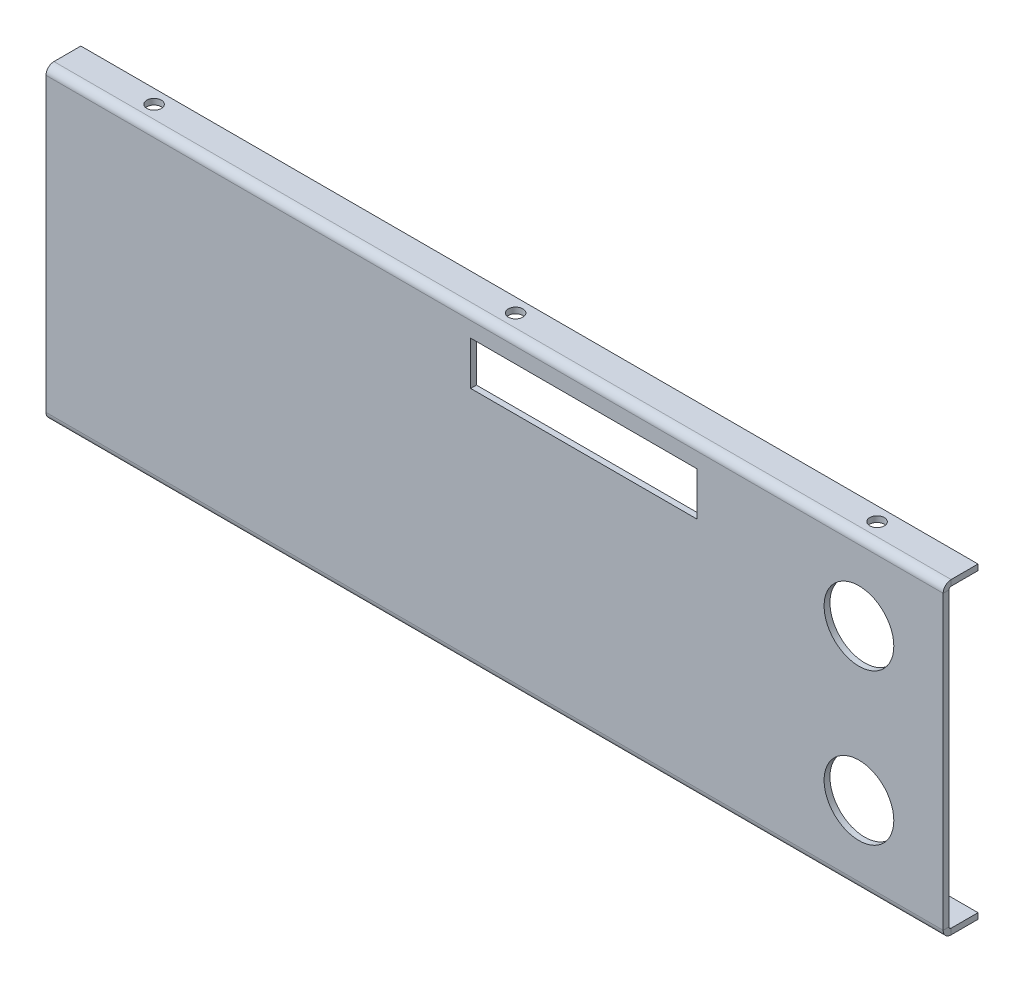
ISO-10303-21;
HEADER;
FILE_DESCRIPTION(('STEP AP214'),'2;1');
FILE_NAME('part.step','',(''),(''),'','','');
FILE_SCHEMA(('AUTOMOTIVE_DESIGN { 1 0 10303 214 1 1 1 1 }'));
ENDSEC;
DATA;
#1=APPLICATION_CONTEXT('core data for automotive mechanical design processes');
#2=APPLICATION_PROTOCOL_DEFINITION('international standard','automotive_design',2000,#1);
#3=PRODUCT_CONTEXT('',#1,'mechanical');
#4=PRODUCT('Part','Part','',(#3));
#5=PRODUCT_RELATED_PRODUCT_CATEGORY('part','',(#4));
#6=PRODUCT_DEFINITION_FORMATION('','',#4);
#7=PRODUCT_DEFINITION_CONTEXT('part definition',#1,'design');
#8=PRODUCT_DEFINITION('design','',#6,#7);
#9=PRODUCT_DEFINITION_SHAPE('','',#8);
#10=(LENGTH_UNIT() NAMED_UNIT(*) SI_UNIT(.MILLI.,.METRE.));
#11=(NAMED_UNIT(*) PLANE_ANGLE_UNIT() SI_UNIT($,.RADIAN.));
#12=(NAMED_UNIT(*) SI_UNIT($,.STERADIAN.) SOLID_ANGLE_UNIT());
#13=UNCERTAINTY_MEASURE_WITH_UNIT(LENGTH_MEASURE(1.E-05),#10,'distance_accuracy_value','');
#14=(GEOMETRIC_REPRESENTATION_CONTEXT(3) GLOBAL_UNCERTAINTY_ASSIGNED_CONTEXT((#13)) GLOBAL_UNIT_ASSIGNED_CONTEXT((#10,
#11,#12)) REPRESENTATION_CONTEXT('',''));
#15=CARTESIAN_POINT('',(0.,0.,0.));
#16=DIRECTION('',(0.,0.,1.));
#17=DIRECTION('',(1.,0.,0.));
#18=AXIS2_PLACEMENT_3D('',#15,#16,#17);
#19=CARTESIAN_POINT('',(0.,0.,-2.));
#20=DIRECTION('',(0.,0.,1.));
#21=DIRECTION('',(1.,0.,0.));
#22=AXIS2_PLACEMENT_3D('',#19,#20,#21);
#23=PLANE('',#22);
#24=DIRECTION('',(-1.,0.,0.));
#25=VECTOR('',#24,1.);
#26=CARTESIAN_POINT('',(0.,98.0000000000052,-2.));
#27=LINE('',#26,#25);
#28=CARTESIAN_POINT('',(69.7866766514257,98.0000000000052,-2.));
#29=VERTEX_POINT('',#28);
#30=CARTESIAN_POINT('',(-8.24041618428802,98.0000000000052,-2.));
#31=VERTEX_POINT('',#30);
#32=EDGE_CURVE('E238',#29,#31,#27,.T.);
#33=ORIENTED_EDGE('',*,*,#32,.T.);
#34=DIRECTION('',(0.,-1.,0.));
#35=VECTOR('',#34,1.);
#36=CARTESIAN_POINT('',(-8.24041618428802,0.,-2.));
#37=LINE('',#36,#35);
#38=CARTESIAN_POINT('',(-8.24041618428802,83.0000000000055,-2.));
#39=VERTEX_POINT('',#38);
#40=EDGE_CURVE('E242',#31,#39,#37,.T.);
#41=ORIENTED_EDGE('',*,*,#40,.T.);
#42=DIRECTION('',(1.,0.,0.));
#43=VECTOR('',#42,1.);
#44=CARTESIAN_POINT('',(0.,83.0000000000055,-2.));
#45=LINE('',#44,#43);
#46=CARTESIAN_POINT('',(69.7866766514257,83.0000000000055,-2.));
#47=VERTEX_POINT('',#46);
#48=EDGE_CURVE('E229',#39,#47,#45,.T.);
#49=ORIENTED_EDGE('',*,*,#48,.T.);
#50=DIRECTION('',(0.,1.,0.));
#51=VECTOR('',#50,1.);
#52=CARTESIAN_POINT('',(69.7866766514257,0.,-2.));
#53=LINE('',#52,#51);
#54=EDGE_CURVE('E202',#47,#29,#53,.T.);
#55=ORIENTED_EDGE('',*,*,#54,.T.);
#56=EDGE_LOOP('',(#33,#41,#49,#55));
#57=FACE_BOUND('',#56,.T.);
#58=CARTESIAN_POINT('',(125.5,79.,-2.));
#59=DIRECTION('',(0.,0.,1.));
#60=DIRECTION('',(1.,0.,0.));
#61=AXIS2_PLACEMENT_3D('',#58,#59,#60);
#62=CIRCLE('',#61,12.);
#63=CARTESIAN_POINT('',(137.5,79.,-2.));
#64=VERTEX_POINT('',#63);
#65=EDGE_CURVE('E258',#64,#64,#62,.T.);
#66=ORIENTED_EDGE('',*,*,#65,.T.);
#67=EDGE_LOOP('',(#66));
#68=FACE_BOUND('',#67,.T.);
#69=CARTESIAN_POINT('',(125.5,27.,-2.));
#70=DIRECTION('',(0.,0.,1.));
#71=DIRECTION('',(1.,0.,0.));
#72=AXIS2_PLACEMENT_3D('',#69,#70,#71);
#73=CIRCLE('',#72,12.);
#74=CARTESIAN_POINT('',(137.5,27.,-2.));
#75=VERTEX_POINT('',#74);
#76=EDGE_CURVE('E251',#75,#75,#73,.T.);
#77=ORIENTED_EDGE('',*,*,#76,.T.);
#78=EDGE_LOOP('',(#77));
#79=FACE_BOUND('',#78,.T.);
#80=DIRECTION('',(1.,0.,0.));
#81=VECTOR('',#80,1.);
#82=CARTESIAN_POINT('',(154.5,103.2634,-2.00000000000002));
#83=LINE('',#82,#81);
#84=CARTESIAN_POINT('',(154.5,103.2634,-2.00000000000002));
#85=VERTEX_POINT('',#84);
#86=CARTESIAN_POINT('',(-154.5,103.2634,-2.00000000000002));
#87=VERTEX_POINT('',#86);
#88=EDGE_CURVE('E321',#85,#87,#83,.F.);
#89=ORIENTED_EDGE('',*,*,#88,.F.);
#90=DIRECTION('',(0.,1.,0.));
#91=VECTOR('',#90,1.);
#92=CARTESIAN_POINT('',(154.5,106.,-2.));
#93=LINE('',#92,#91);
#94=CARTESIAN_POINT('',(154.5,2.73659999999996,-2.00000000000001));
#95=VERTEX_POINT('',#94);
#96=EDGE_CURVE('E13',#95,#85,#93,.T.);
#97=ORIENTED_EDGE('',*,*,#96,.F.);
#98=DIRECTION('',(-1.,0.,0.));
#99=VECTOR('',#98,1.);
#100=CARTESIAN_POINT('',(-154.5,2.73659999999996,-2.00000000000001));
#101=LINE('',#100,#99);
#102=CARTESIAN_POINT('',(-154.5,2.73659999999996,-2.00000000000001));
#103=VERTEX_POINT('',#102);
#104=EDGE_CURVE('E393',#103,#95,#101,.F.);
#105=ORIENTED_EDGE('',*,*,#104,.F.);
#106=DIRECTION('',(0.,-1.,0.));
#107=VECTOR('',#106,1.);
#108=CARTESIAN_POINT('',(-154.5,106.,-2.));
#109=LINE('',#108,#107);
#110=EDGE_CURVE('E90',#87,#103,#109,.T.);
#111=ORIENTED_EDGE('',*,*,#110,.F.);
#112=EDGE_LOOP('',(#89,#97,#105,#111));
#113=FACE_BOUND('',#112,.T.);
#114=ADVANCED_FACE('F80',(#57,#68,#79,#113),#23,.F.);
#115=CARTESIAN_POINT('',(0.,0.,0.));
#116=DIRECTION('',(0.,0.,1.));
#117=DIRECTION('',(1.,0.,0.));
#118=AXIS2_PLACEMENT_3D('',#115,#116,#117);
#119=PLANE('',#118);
#120=DIRECTION('',(0.,-1.,0.));
#121=VECTOR('',#120,1.);
#122=CARTESIAN_POINT('',(-8.24041618428802,98.0000000000052,0.));
#123=LINE('',#122,#121);
#124=CARTESIAN_POINT('',(-8.24041618428802,98.0000000000052,0.));
#125=VERTEX_POINT('',#124);
#126=CARTESIAN_POINT('',(-8.24041618428802,83.0000000000055,0.));
#127=VERTEX_POINT('',#126);
#128=EDGE_CURVE('E106',#125,#127,#123,.T.);
#129=ORIENTED_EDGE('',*,*,#128,.F.);
#130=DIRECTION('',(-1.,0.,0.));
#131=VECTOR('',#130,1.);
#132=CARTESIAN_POINT('',(-8.24041618428802,98.0000000000052,0.));
#133=LINE('',#132,#131);
#134=CARTESIAN_POINT('',(69.7866766514257,98.0000000000052,0.));
#135=VERTEX_POINT('',#134);
#136=EDGE_CURVE('E217',#135,#125,#133,.T.);
#137=ORIENTED_EDGE('',*,*,#136,.F.);
#138=DIRECTION('',(0.,1.,0.));
#139=VECTOR('',#138,1.);
#140=CARTESIAN_POINT('',(69.7866766514257,98.0000000000052,0.));
#141=LINE('',#140,#139);
#142=CARTESIAN_POINT('',(69.7866766514257,83.0000000000055,0.));
#143=VERTEX_POINT('',#142);
#144=EDGE_CURVE('E199',#143,#135,#141,.T.);
#145=ORIENTED_EDGE('',*,*,#144,.F.);
#146=DIRECTION('',(1.,0.,0.));
#147=VECTOR('',#146,1.);
#148=CARTESIAN_POINT('',(-8.24041618428802,83.0000000000055,0.));
#149=LINE('',#148,#147);
#150=EDGE_CURVE('E209',#127,#143,#149,.T.);
#151=ORIENTED_EDGE('',*,*,#150,.F.);
#152=EDGE_LOOP('',(#129,#137,#145,#151));
#153=FACE_BOUND('',#152,.T.);
#154=CARTESIAN_POINT('',(125.5,79.,0.));
#155=DIRECTION('',(0.,0.,1.));
#156=DIRECTION('',(1.,0.,0.));
#157=AXIS2_PLACEMENT_3D('',#154,#155,#156);
#158=CIRCLE('',#157,12.);
#159=CARTESIAN_POINT('',(137.5,79.,0.));
#160=VERTEX_POINT('',#159);
#161=EDGE_CURVE('E247',#160,#160,#158,.T.);
#162=ORIENTED_EDGE('',*,*,#161,.F.);
#163=EDGE_LOOP('',(#162));
#164=FACE_BOUND('',#163,.T.);
#165=CARTESIAN_POINT('',(125.5,27.,0.));
#166=DIRECTION('',(0.,0.,1.));
#167=DIRECTION('',(1.,0.,0.));
#168=AXIS2_PLACEMENT_3D('',#165,#166,#167);
#169=CIRCLE('',#168,12.);
#170=CARTESIAN_POINT('',(137.5,27.,0.));
#171=VERTEX_POINT('',#170);
#172=EDGE_CURVE('E246',#171,#171,#169,.T.);
#173=ORIENTED_EDGE('',*,*,#172,.F.);
#174=EDGE_LOOP('',(#173));
#175=FACE_BOUND('',#174,.T.);
#176=DIRECTION('',(0.,1.,0.));
#177=VECTOR('',#176,1.);
#178=CARTESIAN_POINT('',(154.5,106.,0.));
#179=LINE('',#178,#177);
#180=CARTESIAN_POINT('',(154.5,2.73659999999996,0.));
#181=VERTEX_POINT('',#180);
#182=CARTESIAN_POINT('',(154.5,103.2634,0.));
#183=VERTEX_POINT('',#182);
#184=EDGE_CURVE('E409',#181,#183,#179,.T.);
#185=ORIENTED_EDGE('',*,*,#184,.T.);
#186=DIRECTION('',(1.,0.,0.));
#187=VECTOR('',#186,1.);
#188=CARTESIAN_POINT('',(154.5,103.2634,0.));
#189=LINE('',#188,#187);
#190=CARTESIAN_POINT('',(-154.5,103.2634,0.));
#191=VERTEX_POINT('',#190);
#192=EDGE_CURVE('E304',#183,#191,#189,.F.);
#193=ORIENTED_EDGE('',*,*,#192,.T.);
#194=DIRECTION('',(0.,-1.,0.));
#195=VECTOR('',#194,1.);
#196=CARTESIAN_POINT('',(-154.5,106.,0.));
#197=LINE('',#196,#195);
#198=CARTESIAN_POINT('',(-154.5,2.73659999999991,0.));
#199=VERTEX_POINT('',#198);
#200=EDGE_CURVE('E403',#191,#199,#197,.T.);
#201=ORIENTED_EDGE('',*,*,#200,.T.);
#202=DIRECTION('',(-1.,0.,0.));
#203=VECTOR('',#202,1.);
#204=CARTESIAN_POINT('',(-154.5,2.73659999999991,0.));
#205=LINE('',#204,#203);
#206=EDGE_CURVE('E376',#199,#181,#205,.F.);
#207=ORIENTED_EDGE('',*,*,#206,.T.);
#208=EDGE_LOOP('',(#185,#193,#201,#207));
#209=FACE_BOUND('',#208,.T.);
#210=ADVANCED_FACE('F214',(#153,#164,#175,#209),#119,.T.);
#211=CARTESIAN_POINT('',(154.5,106.,-2.));
#212=DIRECTION('',(1.,0.,0.));
#213=DIRECTION('',(0.,1.,0.));
#214=AXIS2_PLACEMENT_3D('',#211,#212,#213);
#215=PLANE('',#214);
#216=ORIENTED_EDGE('',*,*,#96,.T.);
#217=DIRECTION('',(0.,0.,1.));
#218=VECTOR('',#217,1.);
#219=CARTESIAN_POINT('',(154.5,103.2634,-2.00000000000002));
#220=LINE('',#219,#218);
#221=EDGE_CURVE('E313',#85,#183,#220,.T.);
#222=ORIENTED_EDGE('',*,*,#221,.T.);
#223=ORIENTED_EDGE('',*,*,#184,.F.);
#224=DIRECTION('',(0.,0.,1.));
#225=VECTOR('',#224,1.);
#226=CARTESIAN_POINT('',(154.5,2.73659999999996,-2.00000000000001));
#227=LINE('',#226,#225);
#228=EDGE_CURVE('E399',#95,#181,#227,.T.);
#229=ORIENTED_EDGE('',*,*,#228,.F.);
#230=EDGE_LOOP('',(#216,#222,#223,#229));
#231=FACE_BOUND('',#230,.T.);
#232=ADVANCED_FACE('F496',(#231),#215,.T.);
#233=CARTESIAN_POINT('',(-154.5,106.,-2.));
#234=DIRECTION('',(-1.,0.,0.));
#235=DIRECTION('',(0.,-1.,0.));
#236=AXIS2_PLACEMENT_3D('',#233,#234,#235);
#237=PLANE('',#236);
#238=DIRECTION('',(0.,0.,1.));
#239=VECTOR('',#238,1.);
#240=CARTESIAN_POINT('',(-154.5,103.2634,-2.00000000000002));
#241=LINE('',#240,#239);
#242=EDGE_CURVE('E326',#87,#191,#241,.T.);
#243=ORIENTED_EDGE('',*,*,#242,.F.);
#244=ORIENTED_EDGE('',*,*,#110,.T.);
#245=DIRECTION('',(0.,0.,1.));
#246=VECTOR('',#245,1.);
#247=CARTESIAN_POINT('',(-154.5,2.73659999999996,-2.00000000000001));
#248=LINE('',#247,#246);
#249=EDGE_CURVE('E385',#103,#199,#248,.T.);
#250=ORIENTED_EDGE('',*,*,#249,.T.);
#251=ORIENTED_EDGE('',*,*,#200,.F.);
#252=EDGE_LOOP('',(#243,#244,#250,#251));
#253=FACE_BOUND('',#252,.T.);
#254=ADVANCED_FACE('F82',(#253),#237,.T.);
#255=CARTESIAN_POINT('',(154.5,2.73659999999998,-2.73659999999999));
#256=DIRECTION('',(1.,0.,0.));
#257=DIRECTION('',(0.,0.,-1.));
#258=AXIS2_PLACEMENT_3D('',#255,#256,#257);
#259=PLANE('',#258);
#260=DIRECTION('',(0.,1.,0.));
#261=VECTOR('',#260,1.);
#262=CARTESIAN_POINT('',(154.5,0.,-2.73659999999999));
#263=LINE('',#262,#261);
#264=CARTESIAN_POINT('',(154.5,2.,-2.73659999999999));
#265=VERTEX_POINT('',#264);
#266=CARTESIAN_POINT('',(154.5,0.,-2.73659999999999));
#267=VERTEX_POINT('',#266);
#268=EDGE_CURVE('E330',#265,#267,#263,.F.);
#269=ORIENTED_EDGE('',*,*,#268,.F.);
#270=CARTESIAN_POINT('',(154.5,2.73659999999998,-2.73659999999999));
#271=DIRECTION('',(-1.,0.,0.));
#272=DIRECTION('',(0.,0.,1.));
#273=AXIS2_PLACEMENT_3D('',#270,#271,#272);
#274=CIRCLE('',#273,0.736599999999981);
#275=EDGE_CURVE('E389',#95,#265,#274,.F.);
#276=ORIENTED_EDGE('',*,*,#275,.F.);
#277=ORIENTED_EDGE('',*,*,#228,.T.);
#278=CARTESIAN_POINT('',(154.5,2.73659999999998,-2.73659999999999));
#279=DIRECTION('',(-1.,0.,0.));
#280=DIRECTION('',(0.,0.,1.));
#281=AXIS2_PLACEMENT_3D('',#278,#279,#280);
#282=CIRCLE('',#281,2.73659999999998);
#283=EDGE_CURVE('E380',#181,#267,#282,.F.);
#284=ORIENTED_EDGE('',*,*,#283,.T.);
#285=EDGE_LOOP('',(#269,#276,#277,#284));
#286=FACE_BOUND('',#285,.T.);
#287=ADVANCED_FACE('F507',(#286),#259,.T.);
#288=CARTESIAN_POINT('',(-154.5,2.73659999999998,-2.73659999999999));
#289=DIRECTION('',(1.,0.,0.));
#290=DIRECTION('',(0.,0.,-1.));
#291=AXIS2_PLACEMENT_3D('',#288,#289,#290);
#292=PLANE('',#291);
#293=CARTESIAN_POINT('',(-154.5,2.73659999999998,-2.73659999999999));
#294=DIRECTION('',(-1.,0.,0.));
#295=DIRECTION('',(0.,0.,1.));
#296=AXIS2_PLACEMENT_3D('',#293,#294,#295);
#297=CIRCLE('',#296,0.736599999999981);
#298=CARTESIAN_POINT('',(-154.5,2.,-2.73659999999999));
#299=VERTEX_POINT('',#298);
#300=EDGE_CURVE('E338',#299,#103,#297,.T.);
#301=ORIENTED_EDGE('',*,*,#300,.F.);
#302=DIRECTION('',(0.,1.,0.));
#303=VECTOR('',#302,1.);
#304=CARTESIAN_POINT('',(-154.5,1.99999999999996,-2.73659999999999));
#305=LINE('',#304,#303);
#306=CARTESIAN_POINT('',(-154.5,0.,-2.73659999999998));
#307=VERTEX_POINT('',#306);
#308=EDGE_CURVE('E366',#299,#307,#305,.F.);
#309=ORIENTED_EDGE('',*,*,#308,.T.);
#310=CARTESIAN_POINT('',(-154.5,2.73659999999998,-2.73659999999999));
#311=DIRECTION('',(-1.,0.,0.));
#312=DIRECTION('',(0.,0.,1.));
#313=AXIS2_PLACEMENT_3D('',#310,#311,#312);
#314=CIRCLE('',#313,2.73659999999998);
#315=EDGE_CURVE('E381',#307,#199,#314,.T.);
#316=ORIENTED_EDGE('',*,*,#315,.T.);
#317=ORIENTED_EDGE('',*,*,#249,.F.);
#318=EDGE_LOOP('',(#301,#309,#316,#317));
#319=FACE_BOUND('',#318,.T.);
#320=ADVANCED_FACE('F500',(#319),#292,.F.);
#321=CARTESIAN_POINT('',(-154.5,2.73659999999998,-2.73659999999999));
#322=DIRECTION('',(-1.,0.,0.));
#323=DIRECTION('',(0.,-1.,0.));
#324=AXIS2_PLACEMENT_3D('',#321,#322,#323);
#325=CYLINDRICAL_SURFACE('',#324,2.73659999999998);
#326=ORIENTED_EDGE('',*,*,#206,.F.);
#327=ORIENTED_EDGE('',*,*,#315,.F.);
#328=DIRECTION('',(-1.,0.,0.));
#329=VECTOR('',#328,1.);
#330=CARTESIAN_POINT('',(154.5,0.,-2.73659999999999));
#331=LINE('',#330,#329);
#332=EDGE_CURVE('E363',#307,#267,#331,.F.);
#333=ORIENTED_EDGE('',*,*,#332,.T.);
#334=ORIENTED_EDGE('',*,*,#283,.F.);
#335=EDGE_LOOP('',(#326,#327,#333,#334));
#336=FACE_BOUND('',#335,.T.);
#337=ADVANCED_FACE('F596',(#336),#325,.T.);
#338=CARTESIAN_POINT('',(-154.5,2.73659999999998,-2.73659999999999));
#339=DIRECTION('',(-1.,0.,0.));
#340=DIRECTION('',(0.,-1.,0.));
#341=AXIS2_PLACEMENT_3D('',#338,#339,#340);
#342=CYLINDRICAL_SURFACE('',#341,0.736599999999981);
#343=ORIENTED_EDGE('',*,*,#104,.T.);
#344=ORIENTED_EDGE('',*,*,#275,.T.);
#345=DIRECTION('',(-1.,0.,0.));
#346=VECTOR('',#345,1.);
#347=CARTESIAN_POINT('',(154.5,2.,-2.7366));
#348=LINE('',#347,#346);
#349=EDGE_CURVE('E370',#265,#299,#348,.T.);
#350=ORIENTED_EDGE('',*,*,#349,.T.);
#351=ORIENTED_EDGE('',*,*,#300,.T.);
#352=EDGE_LOOP('',(#343,#344,#350,#351));
#353=FACE_BOUND('',#352,.T.);
#354=ADVANCED_FACE('F594',(#353),#342,.F.);
#355=CARTESIAN_POINT('',(-154.5,0.,-12.));
#356=DIRECTION('',(1.,0.,0.));
#357=DIRECTION('',(0.,1.,0.));
#358=AXIS2_PLACEMENT_3D('',#355,#356,#357);
#359=PLANE('',#358);
#360=ORIENTED_EDGE('',*,*,#308,.F.);
#361=DIRECTION('',(0.,0.,1.));
#362=VECTOR('',#361,1.);
#363=CARTESIAN_POINT('',(-154.5,1.99999999999993,-12.));
#364=LINE('',#363,#362);
#365=CARTESIAN_POINT('',(-154.5,1.99999999999993,-12.));
#366=VERTEX_POINT('',#365);
#367=EDGE_CURVE('E360',#299,#366,#364,.F.);
#368=ORIENTED_EDGE('',*,*,#367,.T.);
#369=DIRECTION('',(0.,1.,0.));
#370=VECTOR('',#369,1.);
#371=CARTESIAN_POINT('',(-154.5,0.,-12.));
#372=LINE('',#371,#370);
#373=CARTESIAN_POINT('',(-154.5,0.,-12.));
#374=VERTEX_POINT('',#373);
#375=EDGE_CURVE('E334',#374,#366,#372,.T.);
#376=ORIENTED_EDGE('',*,*,#375,.F.);
#377=DIRECTION('',(0.,0.,-1.));
#378=VECTOR('',#377,1.);
#379=CARTESIAN_POINT('',(-154.5,0.,0.));
#380=LINE('',#379,#378);
#381=EDGE_CURVE('E350',#307,#374,#380,.T.);
#382=ORIENTED_EDGE('',*,*,#381,.F.);
#383=EDGE_LOOP('',(#360,#368,#376,#382));
#384=FACE_BOUND('',#383,.T.);
#385=ADVANCED_FACE('F587',(#384),#359,.F.);
#386=CARTESIAN_POINT('',(154.5,0.,-1.99999999999999));
#387=DIRECTION('',(-1.,0.,0.));
#388=DIRECTION('',(0.,-1.,0.));
#389=AXIS2_PLACEMENT_3D('',#386,#387,#388);
#390=PLANE('',#389);
#391=ORIENTED_EDGE('',*,*,#268,.T.);
#392=DIRECTION('',(0.,0.,1.));
#393=VECTOR('',#392,1.);
#394=CARTESIAN_POINT('',(154.5,0.,0.));
#395=LINE('',#394,#393);
#396=CARTESIAN_POINT('',(154.5,0.,-12.));
#397=VERTEX_POINT('',#396);
#398=EDGE_CURVE('E343',#397,#267,#395,.T.);
#399=ORIENTED_EDGE('',*,*,#398,.F.);
#400=DIRECTION('',(0.,1.,0.));
#401=VECTOR('',#400,1.);
#402=CARTESIAN_POINT('',(154.5,0.,-12.));
#403=LINE('',#402,#401);
#404=CARTESIAN_POINT('',(154.5,1.99999999999997,-12.));
#405=VERTEX_POINT('',#404);
#406=EDGE_CURVE('E339',#397,#405,#403,.T.);
#407=ORIENTED_EDGE('',*,*,#406,.T.);
#408=DIRECTION('',(0.,0.,-1.));
#409=VECTOR('',#408,1.);
#410=CARTESIAN_POINT('',(154.5,2.,-2.));
#411=LINE('',#410,#409);
#412=EDGE_CURVE('E353',#405,#265,#411,.F.);
#413=ORIENTED_EDGE('',*,*,#412,.T.);
#414=EDGE_LOOP('',(#391,#399,#407,#413));
#415=FACE_BOUND('',#414,.T.);
#416=ADVANCED_FACE('F581',(#415),#390,.F.);
#417=CARTESIAN_POINT('',(0.,0.,0.));
#418=DIRECTION('',(0.,1.,0.));
#419=DIRECTION('',(0.,0.,1.));
#420=AXIS2_PLACEMENT_3D('',#417,#418,#419);
#421=PLANE('',#420);
#422=CARTESIAN_POINT('',(124.500000000138,0.,-7.23659999999993));
#423=DIRECTION('',(0.,1.,0.));
#424=DIRECTION('',(0.,0.,1.));
#425=AXIS2_PLACEMENT_3D('',#422,#423,#424);
#426=CIRCLE('',#425,2.50000000000001);
#427=CARTESIAN_POINT('',(124.500000000138,0.,-4.73659999999992));
#428=VERTEX_POINT('',#427);
#429=EDGE_CURVE('E421',#428,#428,#426,.T.);
#430=ORIENTED_EDGE('',*,*,#429,.T.);
#431=EDGE_LOOP('',(#430));
#432=FACE_BOUND('',#431,.T.);
#433=CARTESIAN_POINT('',(1.37525922911009E-10,0.,-7.23660000000037));
#434=DIRECTION('',(0.,1.,0.));
#435=DIRECTION('',(0.,0.,1.));
#436=AXIS2_PLACEMENT_3D('',#433,#434,#435);
#437=CIRCLE('',#436,2.5);
#438=CARTESIAN_POINT('',(1.37525922911009E-10,-1.07552855510562E-13,-4.73660000000037));
#439=VERTEX_POINT('',#438);
#440=EDGE_CURVE('E457',#439,#439,#437,.T.);
#441=ORIENTED_EDGE('',*,*,#440,.T.);
#442=EDGE_LOOP('',(#441));
#443=FACE_BOUND('',#442,.T.);
#444=CARTESIAN_POINT('',(-124.499999999862,-1.11022302462516E-13,-7.23660000000081));
#445=DIRECTION('',(0.,1.,0.));
#446=DIRECTION('',(0.,0.,1.));
#447=AXIS2_PLACEMENT_3D('',#444,#445,#446);
#448=CIRCLE('',#447,2.5);
#449=CARTESIAN_POINT('',(-124.499999999862,-1.21430643318376E-13,-4.73660000000082));
#450=VERTEX_POINT('',#449);
#451=EDGE_CURVE('E462',#450,#450,#448,.T.);
#452=ORIENTED_EDGE('',*,*,#451,.T.);
#453=EDGE_LOOP('',(#452));
#454=FACE_BOUND('',#453,.T.);
#455=ORIENTED_EDGE('',*,*,#332,.F.);
#456=ORIENTED_EDGE('',*,*,#381,.T.);
#457=DIRECTION('',(1.,0.,0.));
#458=VECTOR('',#457,1.);
#459=CARTESIAN_POINT('',(0.,0.,-12.));
#460=LINE('',#459,#458);
#461=EDGE_CURVE('E347',#374,#397,#460,.T.);
#462=ORIENTED_EDGE('',*,*,#461,.T.);
#463=ORIENTED_EDGE('',*,*,#398,.T.);
#464=EDGE_LOOP('',(#455,#456,#462,#463));
#465=FACE_BOUND('',#464,.T.);
#466=ADVANCED_FACE('F468',(#432,#443,#454,#465),#421,.F.);
#467=CARTESIAN_POINT('',(0.,1.99999999999999,0.));
#468=DIRECTION('',(0.,1.,0.));
#469=DIRECTION('',(0.,0.,1.));
#470=AXIS2_PLACEMENT_3D('',#467,#468,#469);
#471=PLANE('',#470);
#472=CARTESIAN_POINT('',(124.500000000138,1.99999999999998,-7.23659999999992));
#473=DIRECTION('',(0.,1.,0.));
#474=DIRECTION('',(0.,0.,1.));
#475=AXIS2_PLACEMENT_3D('',#472,#473,#474);
#476=CIRCLE('',#475,2.50000000000001);
#477=CARTESIAN_POINT('',(124.500000000138,1.99999999999999,-4.73659999999991));
#478=VERTEX_POINT('',#477);
#479=EDGE_CURVE('E450',#478,#478,#476,.T.);
#480=ORIENTED_EDGE('',*,*,#479,.F.);
#481=EDGE_LOOP('',(#480));
#482=FACE_BOUND('',#481,.T.);
#483=CARTESIAN_POINT('',(1.3752574326327E-10,1.99999999999996,-7.23660000000036));
#484=DIRECTION('',(0.,1.,0.));
#485=DIRECTION('',(0.,0.,1.));
#486=AXIS2_PLACEMENT_3D('',#483,#484,#485);
#487=CIRCLE('',#486,2.5);
#488=CARTESIAN_POINT('',(1.3752574326327E-10,1.99999999999997,-4.73660000000037));
#489=VERTEX_POINT('',#488);
#490=EDGE_CURVE('E431',#489,#489,#487,.T.);
#491=ORIENTED_EDGE('',*,*,#490,.F.);
#492=EDGE_LOOP('',(#491));
#493=FACE_BOUND('',#492,.T.);
#494=CARTESIAN_POINT('',(-124.499999999862,1.99999999999995,-7.23660000000081));
#495=DIRECTION('',(0.,1.,0.));
#496=DIRECTION('',(0.,0.,1.));
#497=AXIS2_PLACEMENT_3D('',#494,#495,#496);
#498=CIRCLE('',#497,2.5);
#499=CARTESIAN_POINT('',(-124.499999999862,1.99999999999996,-4.73660000000081));
#500=VERTEX_POINT('',#499);
#501=EDGE_CURVE('E426',#500,#500,#498,.T.);
#502=ORIENTED_EDGE('',*,*,#501,.F.);
#503=EDGE_LOOP('',(#502));
#504=FACE_BOUND('',#503,.T.);
#505=ORIENTED_EDGE('',*,*,#367,.F.);
#506=ORIENTED_EDGE('',*,*,#349,.F.);
#507=ORIENTED_EDGE('',*,*,#412,.F.);
#508=DIRECTION('',(-1.,0.,0.));
#509=VECTOR('',#508,1.);
#510=CARTESIAN_POINT('',(154.5,1.99999999999997,-12.));
#511=LINE('',#510,#509);
#512=EDGE_CURVE('E357',#366,#405,#511,.F.);
#513=ORIENTED_EDGE('',*,*,#512,.F.);
#514=EDGE_LOOP('',(#505,#506,#507,#513));
#515=FACE_BOUND('',#514,.T.);
#516=ADVANCED_FACE('F580',(#482,#493,#504,#515),#471,.T.);
#517=CARTESIAN_POINT('',(154.5,0.,-12.));
#518=DIRECTION('',(0.,0.,1.));
#519=DIRECTION('',(0.,-1.,0.));
#520=AXIS2_PLACEMENT_3D('',#517,#518,#519);
#521=PLANE('',#520);
#522=ORIENTED_EDGE('',*,*,#512,.T.);
#523=ORIENTED_EDGE('',*,*,#406,.F.);
#524=ORIENTED_EDGE('',*,*,#461,.F.);
#525=ORIENTED_EDGE('',*,*,#375,.T.);
#526=EDGE_LOOP('',(#522,#523,#524,#525));
#527=FACE_BOUND('',#526,.T.);
#528=ADVANCED_FACE('F575',(#527),#521,.F.);
#529=CARTESIAN_POINT('',(-154.5,103.2634,-2.73660000000001));
#530=DIRECTION('',(-1.,0.,0.));
#531=DIRECTION('',(0.,0.,1.));
#532=AXIS2_PLACEMENT_3D('',#529,#530,#531);
#533=PLANE('',#532);
#534=DIRECTION('',(0.,-1.,0.));
#535=VECTOR('',#534,1.);
#536=CARTESIAN_POINT('',(-154.5,106.,-2.7366));
#537=LINE('',#536,#535);
#538=CARTESIAN_POINT('',(-154.5,104.,-2.73660000000001));
#539=VERTEX_POINT('',#538);
#540=CARTESIAN_POINT('',(-154.5,106.,-2.7366));
#541=VERTEX_POINT('',#540);
#542=EDGE_CURVE('E262',#539,#541,#537,.F.);
#543=ORIENTED_EDGE('',*,*,#542,.F.);
#544=CARTESIAN_POINT('',(-154.5,103.2634,-2.73660000000001));
#545=DIRECTION('',(1.,0.,0.));
#546=DIRECTION('',(0.,0.,-1.));
#547=AXIS2_PLACEMENT_3D('',#544,#545,#546);
#548=CIRCLE('',#547,0.73659999999999);
#549=EDGE_CURVE('E317',#87,#539,#548,.F.);
#550=ORIENTED_EDGE('',*,*,#549,.F.);
#551=ORIENTED_EDGE('',*,*,#242,.T.);
#552=CARTESIAN_POINT('',(-154.5,103.2634,-2.73660000000001));
#553=DIRECTION('',(1.,0.,0.));
#554=DIRECTION('',(0.,0.,-1.));
#555=AXIS2_PLACEMENT_3D('',#552,#553,#554);
#556=CIRCLE('',#555,2.73659999999999);
#557=EDGE_CURVE('E308',#191,#541,#556,.F.);
#558=ORIENTED_EDGE('',*,*,#557,.T.);
#559=EDGE_LOOP('',(#543,#550,#551,#558));
#560=FACE_BOUND('',#559,.T.);
#561=ADVANCED_FACE('F523',(#560),#533,.T.);
#562=CARTESIAN_POINT('',(154.5,103.2634,-2.73660000000001));
#563=DIRECTION('',(-1.,0.,0.));
#564=DIRECTION('',(0.,0.,1.));
#565=AXIS2_PLACEMENT_3D('',#562,#563,#564);
#566=PLANE('',#565);
#567=CARTESIAN_POINT('',(154.5,103.2634,-2.73660000000001));
#568=DIRECTION('',(1.,0.,0.));
#569=DIRECTION('',(0.,0.,-1.));
#570=AXIS2_PLACEMENT_3D('',#567,#568,#569);
#571=CIRCLE('',#570,0.73659999999999);
#572=CARTESIAN_POINT('',(154.5,104.,-2.73660000000001));
#573=VERTEX_POINT('',#572);
#574=EDGE_CURVE('E267',#573,#85,#571,.T.);
#575=ORIENTED_EDGE('',*,*,#574,.F.);
#576=DIRECTION('',(0.,-1.,0.));
#577=VECTOR('',#576,1.);
#578=CARTESIAN_POINT('',(154.5,104.,-2.73660000000001));
#579=LINE('',#578,#577);
#580=CARTESIAN_POINT('',(154.5,106.,-2.7366));
#581=VERTEX_POINT('',#580);
#582=EDGE_CURVE('E294',#573,#581,#579,.F.);
#583=ORIENTED_EDGE('',*,*,#582,.T.);
#584=CARTESIAN_POINT('',(154.5,103.2634,-2.73660000000001));
#585=DIRECTION('',(1.,0.,0.));
#586=DIRECTION('',(0.,0.,-1.));
#587=AXIS2_PLACEMENT_3D('',#584,#585,#586);
#588=CIRCLE('',#587,2.73659999999999);
#589=EDGE_CURVE('E309',#581,#183,#588,.T.);
#590=ORIENTED_EDGE('',*,*,#589,.T.);
#591=ORIENTED_EDGE('',*,*,#221,.F.);
#592=EDGE_LOOP('',(#575,#583,#590,#591));
#593=FACE_BOUND('',#592,.T.);
#594=ADVANCED_FACE('F529',(#593),#566,.F.);
#595=CARTESIAN_POINT('',(154.5,103.2634,-2.73660000000001));
#596=DIRECTION('',(1.,0.,0.));
#597=DIRECTION('',(0.,1.,0.));
#598=AXIS2_PLACEMENT_3D('',#595,#596,#597);
#599=CYLINDRICAL_SURFACE('',#598,2.73659999999999);
#600=ORIENTED_EDGE('',*,*,#192,.F.);
#601=ORIENTED_EDGE('',*,*,#589,.F.);
#602=DIRECTION('',(1.,0.,0.));
#603=VECTOR('',#602,1.);
#604=CARTESIAN_POINT('',(-154.5,106.,-2.7366));
#605=LINE('',#604,#603);
#606=EDGE_CURVE('E291',#581,#541,#605,.F.);
#607=ORIENTED_EDGE('',*,*,#606,.T.);
#608=ORIENTED_EDGE('',*,*,#557,.F.);
#609=EDGE_LOOP('',(#600,#601,#607,#608));
#610=FACE_BOUND('',#609,.T.);
#611=ADVANCED_FACE('F527',(#610),#599,.T.);
#612=CARTESIAN_POINT('',(154.5,103.2634,-2.73660000000001));
#613=DIRECTION('',(1.,0.,0.));
#614=DIRECTION('',(0.,1.,0.));
#615=AXIS2_PLACEMENT_3D('',#612,#613,#614);
#616=CYLINDRICAL_SURFACE('',#615,0.73659999999999);
#617=ORIENTED_EDGE('',*,*,#88,.T.);
#618=ORIENTED_EDGE('',*,*,#549,.T.);
#619=DIRECTION('',(1.,0.,0.));
#620=VECTOR('',#619,1.);
#621=CARTESIAN_POINT('',(-154.5,104.,-2.73660000000001));
#622=LINE('',#621,#620);
#623=EDGE_CURVE('E298',#539,#573,#622,.T.);
#624=ORIENTED_EDGE('',*,*,#623,.T.);
#625=ORIENTED_EDGE('',*,*,#574,.T.);
#626=EDGE_LOOP('',(#617,#618,#624,#625));
#627=FACE_BOUND('',#626,.T.);
#628=ADVANCED_FACE('F518',(#627),#616,.F.);
#629=CARTESIAN_POINT('',(154.5,106.,-12.));
#630=DIRECTION('',(-1.,0.,0.));
#631=DIRECTION('',(0.,-1.,0.));
#632=AXIS2_PLACEMENT_3D('',#629,#630,#631);
#633=PLANE('',#632);
#634=ORIENTED_EDGE('',*,*,#582,.F.);
#635=DIRECTION('',(0.,0.,1.));
#636=VECTOR('',#635,1.);
#637=CARTESIAN_POINT('',(154.5,104.,-12.));
#638=LINE('',#637,#636);
#639=CARTESIAN_POINT('',(154.5,104.,-12.));
#640=VERTEX_POINT('',#639);
#641=EDGE_CURVE('E289',#573,#640,#638,.F.);
#642=ORIENTED_EDGE('',*,*,#641,.T.);
#643=DIRECTION('',(0.,-1.,0.));
#644=VECTOR('',#643,1.);
#645=CARTESIAN_POINT('',(154.5,106.,-12.));
#646=LINE('',#645,#644);
#647=CARTESIAN_POINT('',(154.5,106.,-12.));
#648=VERTEX_POINT('',#647);
#649=EDGE_CURVE('E263',#648,#640,#646,.T.);
#650=ORIENTED_EDGE('',*,*,#649,.F.);
#651=DIRECTION('',(0.,0.,-1.));
#652=VECTOR('',#651,1.);
#653=CARTESIAN_POINT('',(154.5,106.,4.48296614966186E-13));
#654=LINE('',#653,#652);
#655=EDGE_CURVE('E279',#581,#648,#654,.T.);
#656=ORIENTED_EDGE('',*,*,#655,.F.);
#657=EDGE_LOOP('',(#634,#642,#650,#656));
#658=FACE_BOUND('',#657,.T.);
#659=ADVANCED_FACE('F540',(#658),#633,.F.);
#660=CARTESIAN_POINT('',(-154.5,106.,-1.99999999999999));
#661=DIRECTION('',(1.,0.,0.));
#662=DIRECTION('',(0.,1.,0.));
#663=AXIS2_PLACEMENT_3D('',#660,#661,#662);
#664=PLANE('',#663);
#665=ORIENTED_EDGE('',*,*,#542,.T.);
#666=DIRECTION('',(0.,0.,1.));
#667=VECTOR('',#666,1.);
#668=CARTESIAN_POINT('',(-154.5,106.,4.48296614966186E-13));
#669=LINE('',#668,#667);
#670=CARTESIAN_POINT('',(-154.5,106.,-12.));
#671=VERTEX_POINT('',#670);
#672=EDGE_CURVE('E272',#671,#541,#669,.T.);
#673=ORIENTED_EDGE('',*,*,#672,.F.);
#674=DIRECTION('',(0.,-1.,0.));
#675=VECTOR('',#674,1.);
#676=CARTESIAN_POINT('',(-154.5,106.,-12.));
#677=LINE('',#676,#675);
#678=CARTESIAN_POINT('',(-154.5,104.,-12.));
#679=VERTEX_POINT('',#678);
#680=EDGE_CURVE('E268',#671,#679,#677,.T.);
#681=ORIENTED_EDGE('',*,*,#680,.T.);
#682=DIRECTION('',(0.,0.,-1.));
#683=VECTOR('',#682,1.);
#684=CARTESIAN_POINT('',(-154.5,104.,-2.));
#685=LINE('',#684,#683);
#686=EDGE_CURVE('E282',#679,#539,#685,.F.);
#687=ORIENTED_EDGE('',*,*,#686,.T.);
#688=EDGE_LOOP('',(#665,#673,#681,#687));
#689=FACE_BOUND('',#688,.T.);
#690=ADVANCED_FACE('F547',(#689),#664,.F.);
#691=CARTESIAN_POINT('',(0.,106.,4.48296614966186E-13));
#692=DIRECTION('',(0.,-1.,0.));
#693=DIRECTION('',(0.,0.,-1.));
#694=AXIS2_PLACEMENT_3D('',#691,#692,#693);
#695=PLANE('',#694);
#696=CARTESIAN_POINT('',(124.500000000138,106.,-7.23659999999949));
#697=DIRECTION('',(0.,-1.,0.));
#698=DIRECTION('',(0.,0.,-1.));
#699=AXIS2_PLACEMENT_3D('',#696,#697,#698);
#700=CIRCLE('',#699,2.50000000000001);
#701=CARTESIAN_POINT('',(124.500000000138,106.,-9.73659999999949));
#702=VERTEX_POINT('',#701);
#703=EDGE_CURVE('E446',#702,#702,#700,.T.);
#704=ORIENTED_EDGE('',*,*,#703,.T.);
#705=EDGE_LOOP('',(#704));
#706=FACE_BOUND('',#705,.T.);
#707=CARTESIAN_POINT('',(1.37516401580862E-10,106.,-7.23659999999993));
#708=DIRECTION('',(0.,-1.,0.));
#709=DIRECTION('',(0.,0.,-1.));
#710=AXIS2_PLACEMENT_3D('',#707,#708,#709);
#711=CIRCLE('',#710,2.5);
#712=CARTESIAN_POINT('',(1.37516401580862E-10,106.,-9.73659999999992));
#713=VERTEX_POINT('',#712);
#714=EDGE_CURVE('E425',#713,#713,#711,.T.);
#715=ORIENTED_EDGE('',*,*,#714,.T.);
#716=EDGE_LOOP('',(#715));
#717=FACE_BOUND('',#716,.T.);
#718=CARTESIAN_POINT('',(-124.499999999862,106.,-7.23660000000037));
#719=DIRECTION('',(0.,-1.,0.));
#720=DIRECTION('',(0.,0.,-1.));
#721=AXIS2_PLACEMENT_3D('',#718,#719,#720);
#722=CIRCLE('',#721,2.5);
#723=CARTESIAN_POINT('',(-124.499999999862,106.,-9.73660000000037));
#724=VERTEX_POINT('',#723);
#725=EDGE_CURVE('E420',#724,#724,#722,.T.);
#726=ORIENTED_EDGE('',*,*,#725,.T.);
#727=EDGE_LOOP('',(#726));
#728=FACE_BOUND('',#727,.T.);
#729=ORIENTED_EDGE('',*,*,#606,.F.);
#730=ORIENTED_EDGE('',*,*,#655,.T.);
#731=DIRECTION('',(-1.,0.,0.));
#732=VECTOR('',#731,1.);
#733=CARTESIAN_POINT('',(0.,106.,-12.));
#734=LINE('',#733,#732);
#735=EDGE_CURVE('E276',#648,#671,#734,.T.);
#736=ORIENTED_EDGE('',*,*,#735,.T.);
#737=ORIENTED_EDGE('',*,*,#672,.T.);
#738=EDGE_LOOP('',(#729,#730,#736,#737));
#739=FACE_BOUND('',#738,.T.);
#740=ADVANCED_FACE('F536',(#706,#717,#728,#739),#695,.F.);
#741=CARTESIAN_POINT('',(0.,104.,4.41313652288499E-13));
#742=DIRECTION('',(0.,-1.,0.));
#743=DIRECTION('',(0.,0.,-1.));
#744=AXIS2_PLACEMENT_3D('',#741,#742,#743);
#745=PLANE('',#744);
#746=CARTESIAN_POINT('',(124.500000000138,104.,-7.23659999999949));
#747=DIRECTION('',(0.,-1.,0.));
#748=DIRECTION('',(0.,0.,-1.));
#749=AXIS2_PLACEMENT_3D('',#746,#747,#748);
#750=CIRCLE('',#749,2.50000000000001);
#751=CARTESIAN_POINT('',(124.500000000138,104.,-9.7365999999995));
#752=VERTEX_POINT('',#751);
#753=EDGE_CURVE('E84',#752,#752,#750,.T.);
#754=ORIENTED_EDGE('',*,*,#753,.F.);
#755=EDGE_LOOP('',(#754));
#756=FACE_BOUND('',#755,.T.);
#757=CARTESIAN_POINT('',(1.37516581228601E-10,104.,-7.23659999999994));
#758=DIRECTION('',(0.,-1.,0.));
#759=DIRECTION('',(0.,0.,-1.));
#760=AXIS2_PLACEMENT_3D('',#757,#758,#759);
#761=CIRCLE('',#760,2.5);
#762=CARTESIAN_POINT('',(1.37516581228601E-10,104.,-9.73659999999993));
#763=VERTEX_POINT('',#762);
#764=EDGE_CURVE('E422',#763,#763,#761,.T.);
#765=ORIENTED_EDGE('',*,*,#764,.F.);
#766=EDGE_LOOP('',(#765));
#767=FACE_BOUND('',#766,.T.);
#768=CARTESIAN_POINT('',(-124.499999999862,104.,-7.23660000000038));
#769=DIRECTION('',(0.,-1.,0.));
#770=DIRECTION('',(0.,0.,-1.));
#771=AXIS2_PLACEMENT_3D('',#768,#769,#770);
#772=CIRCLE('',#771,2.5);
#773=CARTESIAN_POINT('',(-124.499999999862,104.,-9.73660000000038));
#774=VERTEX_POINT('',#773);
#775=EDGE_CURVE('E417',#774,#774,#772,.T.);
#776=ORIENTED_EDGE('',*,*,#775,.F.);
#777=EDGE_LOOP('',(#776));
#778=FACE_BOUND('',#777,.T.);
#779=ORIENTED_EDGE('',*,*,#641,.F.);
#780=ORIENTED_EDGE('',*,*,#623,.F.);
#781=ORIENTED_EDGE('',*,*,#686,.F.);
#782=DIRECTION('',(1.,0.,0.));
#783=VECTOR('',#782,1.);
#784=CARTESIAN_POINT('',(-154.5,104.,-12.));
#785=LINE('',#784,#783);
#786=EDGE_CURVE('E286',#640,#679,#785,.F.);
#787=ORIENTED_EDGE('',*,*,#786,.F.);
#788=EDGE_LOOP('',(#779,#780,#781,#787));
#789=FACE_BOUND('',#788,.T.);
#790=ADVANCED_FACE('F549',(#756,#767,#778,#789),#745,.T.);
#791=CARTESIAN_POINT('',(-154.5,106.,-12.));
#792=DIRECTION('',(0.,0.,1.));
#793=DIRECTION('',(0.,-1.,0.));
#794=AXIS2_PLACEMENT_3D('',#791,#792,#793);
#795=PLANE('',#794);
#796=ORIENTED_EDGE('',*,*,#786,.T.);
#797=ORIENTED_EDGE('',*,*,#680,.F.);
#798=ORIENTED_EDGE('',*,*,#735,.F.);
#799=ORIENTED_EDGE('',*,*,#649,.T.);
#800=EDGE_LOOP('',(#796,#797,#798,#799));
#801=FACE_BOUND('',#800,.T.);
#802=ADVANCED_FACE('F543',(#801),#795,.F.);
#803=CARTESIAN_POINT('',(125.5,27.,-12.));
#804=DIRECTION('',(0.,0.,1.));
#805=DIRECTION('',(1.,0.,0.));
#806=AXIS2_PLACEMENT_3D('',#803,#804,#805);
#807=CYLINDRICAL_SURFACE('',#806,12.);
#808=ORIENTED_EDGE('',*,*,#172,.T.);
#809=EDGE_LOOP('',(#808));
#810=FACE_BOUND('',#809,.T.);
#811=ORIENTED_EDGE('',*,*,#76,.F.);
#812=EDGE_LOOP('',(#811));
#813=FACE_BOUND('',#812,.T.);
#814=ADVANCED_FACE('F557',(#810,#813),#807,.F.);
#815=CARTESIAN_POINT('',(125.5,79.,-12.));
#816=DIRECTION('',(0.,0.,1.));
#817=DIRECTION('',(1.,0.,0.));
#818=AXIS2_PLACEMENT_3D('',#815,#816,#817);
#819=CYLINDRICAL_SURFACE('',#818,12.);
#820=ORIENTED_EDGE('',*,*,#161,.T.);
#821=EDGE_LOOP('',(#820));
#822=FACE_BOUND('',#821,.T.);
#823=ORIENTED_EDGE('',*,*,#65,.F.);
#824=EDGE_LOOP('',(#823));
#825=FACE_BOUND('',#824,.T.);
#826=ADVANCED_FACE('F682',(#822,#825),#819,.F.);
#827=CARTESIAN_POINT('',(-8.24041618428802,98.0000000000052,-12.));
#828=DIRECTION('',(-1.,0.,0.));
#829=DIRECTION('',(0.,0.,1.));
#830=AXIS2_PLACEMENT_3D('',#827,#828,#829);
#831=PLANE('',#830);
#832=DIRECTION('',(0.,0.,1.));
#833=VECTOR('',#832,1.);
#834=CARTESIAN_POINT('',(-8.24041618428802,98.0000000000052,-12.));
#835=LINE('',#834,#833);
#836=EDGE_CURVE('E226',#31,#125,#835,.T.);
#837=ORIENTED_EDGE('',*,*,#836,.T.);
#838=ORIENTED_EDGE('',*,*,#128,.T.);
#839=DIRECTION('',(0.,0.,1.));
#840=VECTOR('',#839,1.);
#841=CARTESIAN_POINT('',(-8.24041618428802,83.0000000000055,-12.));
#842=LINE('',#841,#840);
#843=EDGE_CURVE('E206',#39,#127,#842,.T.);
#844=ORIENTED_EDGE('',*,*,#843,.F.);
#845=ORIENTED_EDGE('',*,*,#40,.F.);
#846=EDGE_LOOP('',(#837,#838,#844,#845));
#847=FACE_BOUND('',#846,.T.);
#848=ADVANCED_FACE('F690',(#847),#831,.F.);
#849=CARTESIAN_POINT('',(-8.24041618428802,98.0000000000052,-12.));
#850=DIRECTION('',(0.,1.,0.));
#851=DIRECTION('',(0.,0.,1.));
#852=AXIS2_PLACEMENT_3D('',#849,#850,#851);
#853=PLANE('',#852);
#854=DIRECTION('',(0.,0.,1.));
#855=VECTOR('',#854,1.);
#856=CARTESIAN_POINT('',(69.7866766514257,98.0000000000052,-12.));
#857=LINE('',#856,#855);
#858=EDGE_CURVE('E205',#29,#135,#857,.T.);
#859=ORIENTED_EDGE('',*,*,#858,.T.);
#860=ORIENTED_EDGE('',*,*,#136,.T.);
#861=ORIENTED_EDGE('',*,*,#836,.F.);
#862=ORIENTED_EDGE('',*,*,#32,.F.);
#863=EDGE_LOOP('',(#859,#860,#861,#862));
#864=FACE_BOUND('',#863,.T.);
#865=ADVANCED_FACE('F700',(#864),#853,.F.);
#866=CARTESIAN_POINT('',(69.7866766514257,98.0000000000052,-12.));
#867=DIRECTION('',(1.,0.,0.));
#868=DIRECTION('',(0.,0.,-1.));
#869=AXIS2_PLACEMENT_3D('',#866,#867,#868);
#870=PLANE('',#869);
#871=DIRECTION('',(0.,0.,1.));
#872=VECTOR('',#871,1.);
#873=CARTESIAN_POINT('',(69.7866766514257,83.0000000000055,-12.));
#874=LINE('',#873,#872);
#875=EDGE_CURVE('E98',#47,#143,#874,.T.);
#876=ORIENTED_EDGE('',*,*,#875,.T.);
#877=ORIENTED_EDGE('',*,*,#144,.T.);
#878=ORIENTED_EDGE('',*,*,#858,.F.);
#879=ORIENTED_EDGE('',*,*,#54,.F.);
#880=EDGE_LOOP('',(#876,#877,#878,#879));
#881=FACE_BOUND('',#880,.T.);
#882=ADVANCED_FACE('F196',(#881),#870,.F.);
#883=CARTESIAN_POINT('',(-8.24041618428802,83.0000000000055,-12.));
#884=DIRECTION('',(0.,-1.,0.));
#885=DIRECTION('',(0.,0.,-1.));
#886=AXIS2_PLACEMENT_3D('',#883,#884,#885);
#887=PLANE('',#886);
#888=ORIENTED_EDGE('',*,*,#843,.T.);
#889=ORIENTED_EDGE('',*,*,#150,.T.);
#890=ORIENTED_EDGE('',*,*,#875,.F.);
#891=ORIENTED_EDGE('',*,*,#48,.F.);
#892=EDGE_LOOP('',(#888,#889,#890,#891));
#893=FACE_BOUND('',#892,.T.);
#894=ADVANCED_FACE('F210',(#893),#887,.F.);
#895=CARTESIAN_POINT('',(-124.499999999862,-1.11022302462516E-13,-7.23660000000081));
#896=DIRECTION('',(0.,1.,0.));
#897=DIRECTION('',(0.,0.,1.));
#898=AXIS2_PLACEMENT_3D('',#895,#896,#897);
#899=CYLINDRICAL_SURFACE('',#898,2.5);
#900=ORIENTED_EDGE('',*,*,#775,.T.);
#901=EDGE_LOOP('',(#900));
#902=FACE_BOUND('',#901,.T.);
#903=ORIENTED_EDGE('',*,*,#725,.F.);
#904=EDGE_LOOP('',(#903));
#905=FACE_BOUND('',#904,.T.);
#906=ADVANCED_FACE('F476',(#902,#905),#899,.F.);
#907=CARTESIAN_POINT('',(1.37525922911009E-10,0.,-7.23660000000037));
#908=DIRECTION('',(0.,1.,0.));
#909=DIRECTION('',(0.,0.,1.));
#910=AXIS2_PLACEMENT_3D('',#907,#908,#909);
#911=CYLINDRICAL_SURFACE('',#910,2.5);
#912=ORIENTED_EDGE('',*,*,#764,.T.);
#913=EDGE_LOOP('',(#912));
#914=FACE_BOUND('',#913,.T.);
#915=ORIENTED_EDGE('',*,*,#714,.F.);
#916=EDGE_LOOP('',(#915));
#917=FACE_BOUND('',#916,.T.);
#918=ADVANCED_FACE('F484',(#914,#917),#911,.F.);
#919=CARTESIAN_POINT('',(124.500000000138,0.,-7.23659999999993));
#920=DIRECTION('',(0.,1.,0.));
#921=DIRECTION('',(0.,0.,1.));
#922=AXIS2_PLACEMENT_3D('',#919,#920,#921);
#923=CYLINDRICAL_SURFACE('',#922,2.50000000000001);
#924=ORIENTED_EDGE('',*,*,#753,.T.);
#925=EDGE_LOOP('',(#924));
#926=FACE_BOUND('',#925,.T.);
#927=ORIENTED_EDGE('',*,*,#703,.F.);
#928=EDGE_LOOP('',(#927));
#929=FACE_BOUND('',#928,.T.);
#930=ADVANCED_FACE('F474',(#926,#929),#923,.F.);
#931=ORIENTED_EDGE('',*,*,#501,.T.);
#932=EDGE_LOOP('',(#931));
#933=FACE_BOUND('',#932,.T.);
#934=ORIENTED_EDGE('',*,*,#451,.F.);
#935=EDGE_LOOP('',(#934));
#936=FACE_BOUND('',#935,.T.);
#937=ADVANCED_FACE('F471',(#933,#936),#899,.F.);
#938=ORIENTED_EDGE('',*,*,#490,.T.);
#939=EDGE_LOOP('',(#938));
#940=FACE_BOUND('',#939,.T.);
#941=ORIENTED_EDGE('',*,*,#440,.F.);
#942=EDGE_LOOP('',(#941));
#943=FACE_BOUND('',#942,.T.);
#944=ADVANCED_FACE('F473',(#940,#943),#911,.F.);
#945=ORIENTED_EDGE('',*,*,#479,.T.);
#946=EDGE_LOOP('',(#945));
#947=FACE_BOUND('',#946,.T.);
#948=ORIENTED_EDGE('',*,*,#429,.F.);
#949=EDGE_LOOP('',(#948));
#950=FACE_BOUND('',#949,.T.);
#951=ADVANCED_FACE('F481',(#947,#950),#923,.F.);
#952=CLOSED_SHELL('',(#114,#210,#232,#254,#287,#320,#337,#354,#385,#416,#466,#516,#528,#561,
#594,#611,#628,#659,#690,#740,#790,#802,#814,#826,#848,#865,#882,#894,#906,#918,#930,#937,#944,#951));
#953=MANIFOLD_SOLID_BREP('B2',#952);
#954=ADVANCED_BREP_SHAPE_REPRESENTATION('',(#18,#953),#14);
#955=SHAPE_DEFINITION_REPRESENTATION(#9,#954);
ENDSEC;
END-ISO-10303-21;
